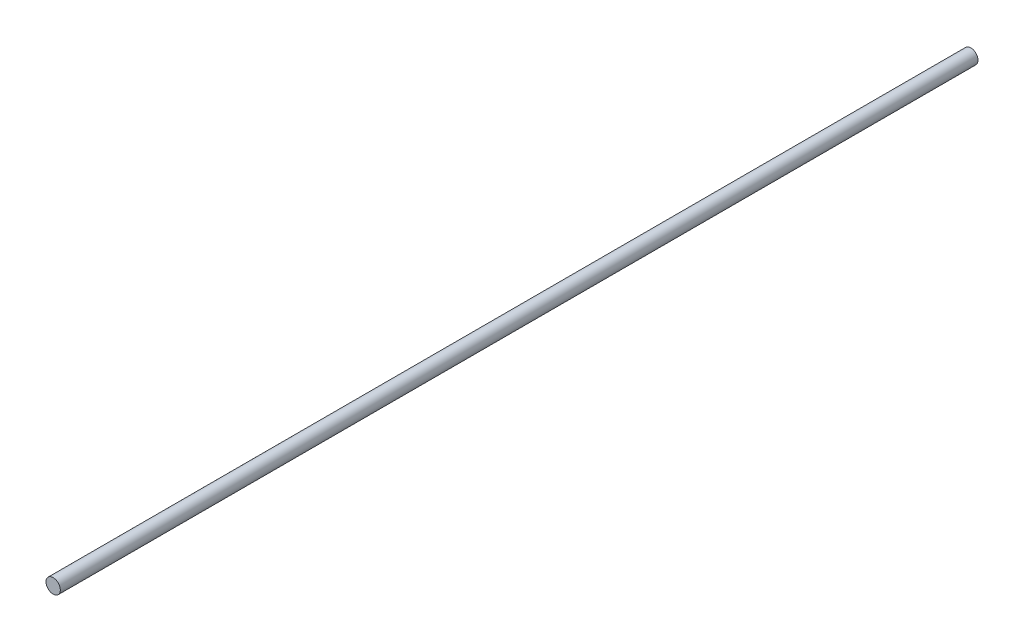
ISO-10303-21;
HEADER;
FILE_DESCRIPTION(('STEP AP214'),'2;1');
FILE_NAME('part.step','',(''),(''),'','','');
FILE_SCHEMA(('AUTOMOTIVE_DESIGN { 1 0 10303 214 1 1 1 1 }'));
ENDSEC;
DATA;
#1=APPLICATION_CONTEXT('core data for automotive mechanical design processes');
#2=APPLICATION_PROTOCOL_DEFINITION('international standard','automotive_design',2000,#1);
#3=PRODUCT_CONTEXT('',#1,'mechanical');
#4=PRODUCT('Part','Part','',(#3));
#5=PRODUCT_RELATED_PRODUCT_CATEGORY('part','',(#4));
#6=PRODUCT_DEFINITION_FORMATION('','',#4);
#7=PRODUCT_DEFINITION_CONTEXT('part definition',#1,'design');
#8=PRODUCT_DEFINITION('design','',#6,#7);
#9=PRODUCT_DEFINITION_SHAPE('','',#8);
#10=(LENGTH_UNIT() NAMED_UNIT(*) SI_UNIT(.MILLI.,.METRE.));
#11=(NAMED_UNIT(*) PLANE_ANGLE_UNIT() SI_UNIT($,.RADIAN.));
#12=(NAMED_UNIT(*) SI_UNIT($,.STERADIAN.) SOLID_ANGLE_UNIT());
#13=UNCERTAINTY_MEASURE_WITH_UNIT(LENGTH_MEASURE(1.E-05),#10,'distance_accuracy_value','');
#14=(GEOMETRIC_REPRESENTATION_CONTEXT(3) GLOBAL_UNCERTAINTY_ASSIGNED_CONTEXT((#13)) GLOBAL_UNIT_ASSIGNED_CONTEXT((#10,
#11,#12)) REPRESENTATION_CONTEXT('',''));
#15=CARTESIAN_POINT('',(0.,0.,0.));
#16=DIRECTION('',(0.,0.,1.));
#17=DIRECTION('',(1.,0.,0.));
#18=AXIS2_PLACEMENT_3D('',#15,#16,#17);
#19=CARTESIAN_POINT('',(0.,0.,406.4));
#20=DIRECTION('',(0.,0.,-1.));
#21=DIRECTION('',(-1.,0.,0.));
#22=AXIS2_PLACEMENT_3D('',#19,#20,#21);
#23=CYLINDRICAL_SURFACE('',#22,3.175);
#24=CARTESIAN_POINT('',(0.,0.,406.4));
#25=DIRECTION('',(0.,0.,1.));
#26=DIRECTION('',(1.,0.,0.));
#27=AXIS2_PLACEMENT_3D('',#24,#25,#26);
#28=CIRCLE('',#27,3.175);
#29=CARTESIAN_POINT('',(3.175,0.,406.4));
#30=VERTEX_POINT('',#29);
#31=EDGE_CURVE('E10',#30,#30,#28,.T.);
#32=ORIENTED_EDGE('',*,*,#31,.F.);
#33=EDGE_LOOP('',(#32));
#34=FACE_BOUND('',#33,.T.);
#35=CARTESIAN_POINT('',(0.,0.,0.));
#36=DIRECTION('',(0.,0.,1.));
#37=DIRECTION('',(1.,0.,0.));
#38=AXIS2_PLACEMENT_3D('',#35,#36,#37);
#39=CIRCLE('',#38,3.175);
#40=CARTESIAN_POINT('',(3.175,0.,0.));
#41=VERTEX_POINT('',#40);
#42=EDGE_CURVE('E33',#41,#41,#39,.T.);
#43=ORIENTED_EDGE('',*,*,#42,.T.);
#44=EDGE_LOOP('',(#43));
#45=FACE_BOUND('',#44,.T.);
#46=ADVANCED_FACE('F30',(#34,#45),#23,.T.);
#47=CARTESIAN_POINT('',(0.,0.,406.4));
#48=DIRECTION('',(0.,0.,1.));
#49=DIRECTION('',(1.,0.,0.));
#50=AXIS2_PLACEMENT_3D('',#47,#48,#49);
#51=PLANE('',#50);
#52=ORIENTED_EDGE('',*,*,#31,.T.);
#53=EDGE_LOOP('',(#52));
#54=FACE_BOUND('',#53,.T.);
#55=ADVANCED_FACE('F45',(#54),#51,.T.);
#56=CARTESIAN_POINT('',(0.,0.,0.));
#57=DIRECTION('',(0.,0.,1.));
#58=DIRECTION('',(1.,0.,0.));
#59=AXIS2_PLACEMENT_3D('',#56,#57,#58);
#60=PLANE('',#59);
#61=ORIENTED_EDGE('',*,*,#42,.F.);
#62=EDGE_LOOP('',(#61));
#63=FACE_BOUND('',#62,.T.);
#64=ADVANCED_FACE('F43',(#63),#60,.F.);
#65=CLOSED_SHELL('',(#46,#55,#64));
#66=MANIFOLD_SOLID_BREP('B2',#65);
#67=ADVANCED_BREP_SHAPE_REPRESENTATION('',(#18,#66),#14);
#68=SHAPE_DEFINITION_REPRESENTATION(#9,#67);
ENDSEC;
END-ISO-10303-21;
